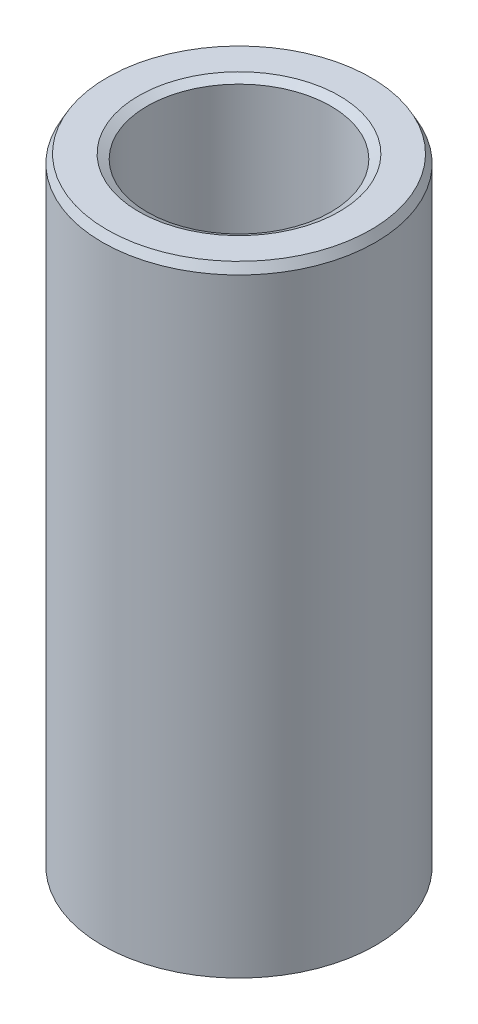
ISO-10303-21;
HEADER;
FILE_DESCRIPTION(('STEP AP214'),'2;1');
FILE_NAME('part.step','',(''),(''),'','','');
FILE_SCHEMA(('AUTOMOTIVE_DESIGN { 1 0 10303 214 1 1 1 1 }'));
ENDSEC;
DATA;
#1=APPLICATION_CONTEXT('core data for automotive mechanical design processes');
#2=APPLICATION_PROTOCOL_DEFINITION('international standard','automotive_design',2000,#1);
#3=PRODUCT_CONTEXT('',#1,'mechanical');
#4=PRODUCT('Part','Part','',(#3));
#5=PRODUCT_RELATED_PRODUCT_CATEGORY('part','',(#4));
#6=PRODUCT_DEFINITION_FORMATION('','',#4);
#7=PRODUCT_DEFINITION_CONTEXT('part definition',#1,'design');
#8=PRODUCT_DEFINITION('design','',#6,#7);
#9=PRODUCT_DEFINITION_SHAPE('','',#8);
#10=(LENGTH_UNIT() NAMED_UNIT(*) SI_UNIT(.MILLI.,.METRE.));
#11=(NAMED_UNIT(*) PLANE_ANGLE_UNIT() SI_UNIT($,.RADIAN.));
#12=(NAMED_UNIT(*) SI_UNIT($,.STERADIAN.) SOLID_ANGLE_UNIT());
#13=UNCERTAINTY_MEASURE_WITH_UNIT(LENGTH_MEASURE(1.E-05),#10,'distance_accuracy_value','');
#14=(GEOMETRIC_REPRESENTATION_CONTEXT(3) GLOBAL_UNCERTAINTY_ASSIGNED_CONTEXT((#13)) GLOBAL_UNIT_ASSIGNED_CONTEXT((#10,
#11,#12)) REPRESENTATION_CONTEXT('',''));
#15=CARTESIAN_POINT('',(0.,0.,0.));
#16=DIRECTION('',(0.,0.,1.));
#17=DIRECTION('',(1.,0.,0.));
#18=AXIS2_PLACEMENT_3D('',#15,#16,#17);
#19=CARTESIAN_POINT('',(0.,159.440543098531,0.));
#20=DIRECTION('',(0.,-1.,0.));
#21=DIRECTION('',(0.,0.,-1.));
#22=AXIS2_PLACEMENT_3D('',#19,#20,#21);
#23=CYLINDRICAL_SURFACE('',#22,35.);
#24=CARTESIAN_POINT('',(0.,1.19776101167968,0.));
#25=DIRECTION('',(0.,1.,0.));
#26=DIRECTION('',(0.,0.,1.));
#27=AXIS2_PLACEMENT_3D('',#24,#25,#26);
#28=CIRCLE('',#27,35.);
#29=CARTESIAN_POINT('',(0.,1.19776101167968,35.));
#30=VERTEX_POINT('',#29);
#31=EDGE_CURVE('E10',#30,#30,#28,.T.);
#32=ORIENTED_EDGE('',*,*,#31,.T.);
#33=EDGE_LOOP('',(#32));
#34=FACE_BOUND('',#33,.T.);
#35=CARTESIAN_POINT('',(0.,157.253760760248,0.));
#36=DIRECTION('',(0.,1.,0.));
#37=DIRECTION('',(0.,0.,1.));
#38=AXIS2_PLACEMENT_3D('',#35,#36,#37);
#39=CIRCLE('',#38,35.);
#40=CARTESIAN_POINT('',(0.,157.253760760248,35.));
#41=VERTEX_POINT('',#40);
#42=EDGE_CURVE('E50',#41,#41,#39,.F.);
#43=ORIENTED_EDGE('',*,*,#42,.T.);
#44=EDGE_LOOP('',(#43));
#45=FACE_BOUND('',#44,.T.);
#46=ADVANCED_FACE('F39',(#34,#45),#23,.T.);
#47=CARTESIAN_POINT('',(0.,159.440543098531,0.));
#48=DIRECTION('',(0.,1.,0.));
#49=DIRECTION('',(0.,0.,1.));
#50=AXIS2_PLACEMENT_3D('',#47,#48,#49);
#51=PLANE('',#50);
#52=CARTESIAN_POINT('',(0.,159.440543098531,0.));
#53=DIRECTION('',(0.,1.,0.));
#54=DIRECTION('',(0.,0.,1.));
#55=AXIS2_PLACEMENT_3D('',#52,#53,#54);
#56=CIRCLE('',#55,25.7219694681736);
#57=CARTESIAN_POINT('',(0.,159.440543098531,25.7219694681736));
#58=VERTEX_POINT('',#57);
#59=EDGE_CURVE('E58',#58,#58,#56,.F.);
#60=ORIENTED_EDGE('',*,*,#59,.T.);
#61=EDGE_LOOP('',(#60));
#62=FACE_BOUND('',#61,.T.);
#63=CARTESIAN_POINT('',(0.,159.440543098531,0.));
#64=DIRECTION('',(0.,1.,0.));
#65=DIRECTION('',(0.,0.,1.));
#66=AXIS2_PLACEMENT_3D('',#63,#64,#65);
#67=CIRCLE('',#66,33.8022389883203);
#68=CARTESIAN_POINT('',(0.,159.440543098531,33.8022389883203));
#69=VERTEX_POINT('',#68);
#70=EDGE_CURVE('E61',#69,#69,#67,.T.);
#71=ORIENTED_EDGE('',*,*,#70,.T.);
#72=EDGE_LOOP('',(#71));
#73=FACE_BOUND('',#72,.T.);
#74=ADVANCED_FACE('F88',(#62,#73),#51,.T.);
#75=CARTESIAN_POINT('',(0.,0.,0.));
#76=DIRECTION('',(0.,1.,0.));
#77=DIRECTION('',(0.,0.,1.));
#78=AXIS2_PLACEMENT_3D('',#75,#76,#77);
#79=PLANE('',#78);
#80=CARTESIAN_POINT('',(0.,0.,0.));
#81=DIRECTION('',(0.,1.,0.));
#82=DIRECTION('',(0.,0.,1.));
#83=AXIS2_PLACEMENT_3D('',#80,#81,#82);
#84=CIRCLE('',#83,24.7329481415697);
#85=CARTESIAN_POINT('',(0.,0.,24.7329481415697));
#86=VERTEX_POINT('',#85);
#87=EDGE_CURVE('E51',#86,#86,#84,.T.);
#88=ORIENTED_EDGE('',*,*,#87,.T.);
#89=EDGE_LOOP('',(#88));
#90=FACE_BOUND('',#89,.T.);
#91=CARTESIAN_POINT('',(0.,0.,0.));
#92=DIRECTION('',(0.,1.,0.));
#93=DIRECTION('',(0.,0.,1.));
#94=AXIS2_PLACEMENT_3D('',#91,#92,#93);
#95=CIRCLE('',#94,32.8132176617164);
#96=CARTESIAN_POINT('',(0.,0.,32.8132176617164));
#97=VERTEX_POINT('',#96);
#98=EDGE_CURVE('E54',#97,#97,#95,.F.);
#99=ORIENTED_EDGE('',*,*,#98,.T.);
#100=EDGE_LOOP('',(#99));
#101=FACE_BOUND('',#100,.T.);
#102=ADVANCED_FACE('F83',(#90,#101),#79,.F.);
#103=CARTESIAN_POINT('',(0.,159.440543098531,0.));
#104=DIRECTION('',(0.,-1.,0.));
#105=DIRECTION('',(0.,0.,-1.));
#106=AXIS2_PLACEMENT_3D('',#103,#104,#105);
#107=CYLINDRICAL_SURFACE('',#106,23.53518712989);
#108=CARTESIAN_POINT('',(0.,158.242782086852,0.));
#109=DIRECTION('',(0.,1.,0.));
#110=DIRECTION('',(0.,0.,1.));
#111=AXIS2_PLACEMENT_3D('',#108,#109,#110);
#112=CIRCLE('',#111,23.53518712989);
#113=CARTESIAN_POINT('',(0.,158.242782086852,23.53518712989));
#114=VERTEX_POINT('',#113);
#115=EDGE_CURVE('E67',#114,#114,#112,.T.);
#116=ORIENTED_EDGE('',*,*,#115,.T.);
#117=EDGE_LOOP('',(#116));
#118=FACE_BOUND('',#117,.T.);
#119=CARTESIAN_POINT('',(0.,2.18678233828359,0.));
#120=DIRECTION('',(0.,1.,0.));
#121=DIRECTION('',(0.,0.,1.));
#122=AXIS2_PLACEMENT_3D('',#119,#120,#121);
#123=CIRCLE('',#122,23.53518712989);
#124=CARTESIAN_POINT('',(0.,2.18678233828359,23.53518712989));
#125=VERTEX_POINT('',#124);
#126=EDGE_CURVE('E69',#125,#125,#123,.F.);
#127=ORIENTED_EDGE('',*,*,#126,.T.);
#128=EDGE_LOOP('',(#127));
#129=FACE_BOUND('',#128,.T.);
#130=ADVANCED_FACE('F71',(#118,#129),#107,.F.);
#131=CARTESIAN_POINT('',(0.,158.242782086852,0.));
#132=DIRECTION('',(0.,1.,0.));
#133=DIRECTION('',(0.,0.,1.));
#134=AXIS2_PLACEMENT_3D('',#131,#132,#133);
#135=CONICAL_SURFACE('',#134,23.53518712989,1.06969944531557);
#136=ORIENTED_EDGE('',*,*,#59,.F.);
#137=EDGE_LOOP('',(#136));
#138=FACE_BOUND('',#137,.T.);
#139=ORIENTED_EDGE('',*,*,#115,.F.);
#140=EDGE_LOOP('',(#139));
#141=FACE_BOUND('',#140,.T.);
#142=ADVANCED_FACE('F77',(#138,#141),#135,.F.);
#143=CARTESIAN_POINT('',(0.,0.,0.));
#144=DIRECTION('',(0.,-1.,0.));
#145=DIRECTION('',(0.,0.,-1.));
#146=AXIS2_PLACEMENT_3D('',#143,#144,#145);
#147=CONICAL_SURFACE('',#146,24.7329481415697,0.501096881479318);
#148=ORIENTED_EDGE('',*,*,#126,.F.);
#149=EDGE_LOOP('',(#148));
#150=FACE_BOUND('',#149,.T.);
#151=ORIENTED_EDGE('',*,*,#87,.F.);
#152=EDGE_LOOP('',(#151));
#153=FACE_BOUND('',#152,.T.);
#154=ADVANCED_FACE('F73',(#150,#153),#147,.F.);
#155=CARTESIAN_POINT('',(0.,1.19776101167968,0.));
#156=DIRECTION('',(0.,1.,0.));
#157=DIRECTION('',(0.,0.,1.));
#158=AXIS2_PLACEMENT_3D('',#155,#156,#157);
#159=CONICAL_SURFACE('',#158,35.,1.06969944531557);
#160=ORIENTED_EDGE('',*,*,#98,.F.);
#161=EDGE_LOOP('',(#160));
#162=FACE_BOUND('',#161,.T.);
#163=ORIENTED_EDGE('',*,*,#31,.F.);
#164=EDGE_LOOP('',(#163));
#165=FACE_BOUND('',#164,.T.);
#166=ADVANCED_FACE('F76',(#162,#165),#159,.T.);
#167=CARTESIAN_POINT('',(0.,159.440543098531,0.));
#168=DIRECTION('',(0.,-1.,0.));
#169=DIRECTION('',(0.,0.,-1.));
#170=AXIS2_PLACEMENT_3D('',#167,#168,#169);
#171=CONICAL_SURFACE('',#170,33.8022389883203,0.501096881479326);
#172=ORIENTED_EDGE('',*,*,#42,.F.);
#173=EDGE_LOOP('',(#172));
#174=FACE_BOUND('',#173,.T.);
#175=ORIENTED_EDGE('',*,*,#70,.F.);
#176=EDGE_LOOP('',(#175));
#177=FACE_BOUND('',#176,.T.);
#178=ADVANCED_FACE('F45',(#174,#177),#171,.T.);
#179=CLOSED_SHELL('',(#46,#74,#102,#130,#142,#154,#166,#178));
#180=MANIFOLD_SOLID_BREP('B2',#179);
#181=ADVANCED_BREP_SHAPE_REPRESENTATION('',(#18,#180),#14);
#182=SHAPE_DEFINITION_REPRESENTATION(#9,#181);
ENDSEC;
END-ISO-10303-21;
